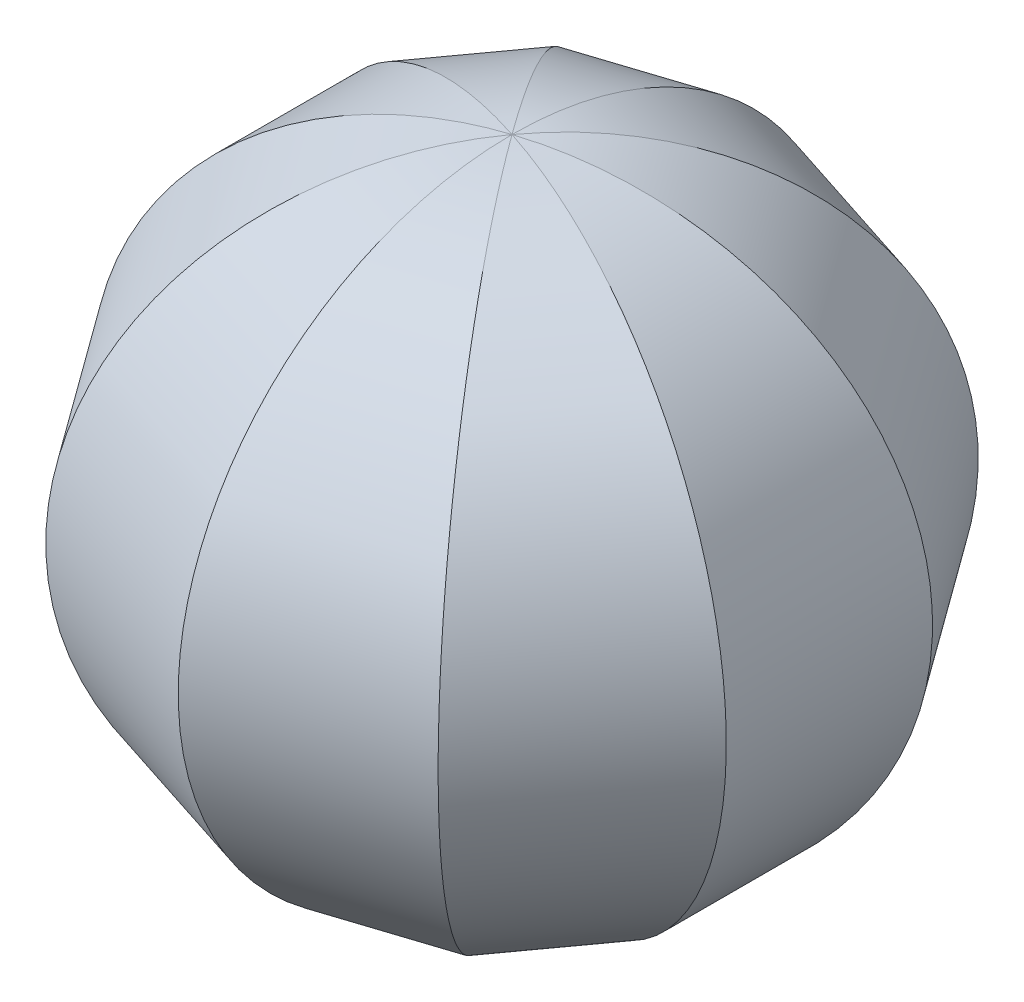
ISO-10303-21;
HEADER;
FILE_DESCRIPTION(('STEP AP214'),'2;1');
FILE_NAME('part.step','',(''),(''),'','','');
FILE_SCHEMA(('AUTOMOTIVE_DESIGN { 1 0 10303 214 1 1 1 1 }'));
ENDSEC;
DATA;
#1=APPLICATION_CONTEXT('core data for automotive mechanical design processes');
#2=APPLICATION_PROTOCOL_DEFINITION('international standard','automotive_design',2000,#1);
#3=PRODUCT_CONTEXT('',#1,'mechanical');
#4=PRODUCT('Part','Part','',(#3));
#5=PRODUCT_RELATED_PRODUCT_CATEGORY('part','',(#4));
#6=PRODUCT_DEFINITION_FORMATION('','',#4);
#7=PRODUCT_DEFINITION_CONTEXT('part definition',#1,'design');
#8=PRODUCT_DEFINITION('design','',#6,#7);
#9=PRODUCT_DEFINITION_SHAPE('','',#8);
#10=(LENGTH_UNIT() NAMED_UNIT(*) SI_UNIT(.MILLI.,.METRE.));
#11=(NAMED_UNIT(*) PLANE_ANGLE_UNIT() SI_UNIT($,.RADIAN.));
#12=(NAMED_UNIT(*) SI_UNIT($,.STERADIAN.) SOLID_ANGLE_UNIT());
#13=UNCERTAINTY_MEASURE_WITH_UNIT(LENGTH_MEASURE(1.E-05),#10,'distance_accuracy_value','');
#14=(GEOMETRIC_REPRESENTATION_CONTEXT(3) GLOBAL_UNCERTAINTY_ASSIGNED_CONTEXT((#13)) GLOBAL_UNIT_ASSIGNED_CONTEXT((#10,
#11,#12)) REPRESENTATION_CONTEXT('',''));
#15=CARTESIAN_POINT('',(0.,0.,0.));
#16=DIRECTION('',(0.,0.,1.));
#17=DIRECTION('',(1.,0.,0.));
#18=AXIS2_PLACEMENT_3D('',#15,#16,#17);
#19=CARTESIAN_POINT('',(1450.,-2626.30919733378,17382.735608421));
#20=DIRECTION('',(0.,-1.,0.));
#21=DIRECTION('',(1.,0.,0.));
#22=AXIS2_PLACEMENT_3D('',#19,#20,#21);
#23=PLANE('',#22);
#24=DIRECTION('',(0.587785252292462,0.,-0.809016994374955));
#25=VECTOR('',#24,1.);
#26=CARTESIAN_POINT('',(-8672.34824494125,-2626.30919733378,14403.3506765883));
#27=LINE('',#26,#25);
#28=CARTESIAN_POINT('',(896.149283687364,-2626.30919733378,1233.44367211045));
#29=VERTEX_POINT('',#28);
#30=CARTESIAN_POINT('',(1450.,-2626.30919733378,471.133559537705));
#31=VERTEX_POINT('',#30);
#32=EDGE_CURVE('E146',#29,#31,#27,.T.);
#33=ORIENTED_EDGE('',*,*,#32,.F.);
#34=DIRECTION('',(0.95105651629515,0.,-0.309016994374958));
#35=VECTOR('',#34,1.);
#36=CARTESIAN_POINT('',(-15482.1542225907,-2626.30919733378,6555.07707218086));
#37=LINE('',#36,#35);
#38=CARTESIAN_POINT('',(2.04281036531029E-11,-2626.30919733378,1524.62022514549));
#39=VERTEX_POINT('',#38);
#40=EDGE_CURVE('E220',#39,#29,#37,.T.);
#41=ORIENTED_EDGE('',*,*,#40,.F.);
#42=DIRECTION('',(0.951056516295157,0.,0.309016994374938));
#43=VECTOR('',#42,1.);
#44=CARTESIAN_POINT('',(-16378.3035062781,-2626.30919733378,-3797.01317492458));
#45=LINE('',#44,#43);
#46=CARTESIAN_POINT('',(-896.14928368734,-2626.30919733378,1233.44367211046));
#47=VERTEX_POINT('',#46);
#48=EDGE_CURVE('E224',#47,#39,#45,.T.);
#49=ORIENTED_EDGE('',*,*,#48,.F.);
#50=DIRECTION('',(0.58778525229248,0.,0.809016994374942));
#51=VECTOR('',#50,1.);
#52=CARTESIAN_POINT('',(-11018.4975286289,-2626.30919733378,-12698.77344494));
#53=LINE('',#52,#51);
#54=CARTESIAN_POINT('',(-1450.,-2626.30919733378,471.133559537726));
#55=VERTEX_POINT('',#54);
#56=EDGE_CURVE('E64',#55,#47,#53,.T.);
#57=ORIENTED_EDGE('',*,*,#56,.F.);
#58=DIRECTION('',(0.,0.,1.));
#59=VECTOR('',#58,1.);
#60=CARTESIAN_POINT('',(-1450.,-2626.30919733378,-16750.0338744229));
#61=LINE('',#60,#59);
#62=CARTESIAN_POINT('',(-1450.,-2626.30919733378,-471.133559537707));
#63=VERTEX_POINT('',#62);
#64=EDGE_CURVE('E234',#63,#55,#61,.T.);
#65=ORIENTED_EDGE('',*,*,#64,.F.);
#66=DIRECTION('',(-0.587785252292469,0.,0.809016994374951));
#67=VECTOR('',#66,1.);
#68=CARTESIAN_POINT('',(8672.34824494136,-2626.30919733378,-14403.3506765883));
#69=LINE('',#68,#67);
#70=CARTESIAN_POINT('',(-896.149283687354,-2626.30919733378,-1233.44367211045));
#71=VERTEX_POINT('',#70);
#72=EDGE_CURVE('E236',#71,#63,#69,.T.);
#73=ORIENTED_EDGE('',*,*,#72,.F.);
#74=DIRECTION('',(-0.951056516295152,0.,0.309016994374952));
#75=VECTOR('',#74,1.);
#76=CARTESIAN_POINT('',(15482.1542225907,-2626.30919733378,-6555.07707218075));
#77=LINE('',#76,#75);
#78=CARTESIAN_POINT('',(-5.32907051820075E-12,-2626.30919733378,-1524.62022514549));
#79=VERTEX_POINT('',#78);
#80=EDGE_CURVE('E239',#79,#71,#77,.T.);
#81=ORIENTED_EDGE('',*,*,#80,.F.);
#82=DIRECTION('',(-0.951056516295154,0.,-0.309016994374945));
#83=VECTOR('',#82,1.);
#84=CARTESIAN_POINT('',(16378.3035062781,-2626.30919733378,3797.01317492469));
#85=LINE('',#84,#83);
#86=CARTESIAN_POINT('',(896.149283687343,-2626.30919733378,-1233.44367211046));
#87=VERTEX_POINT('',#86);
#88=EDGE_CURVE('E242',#87,#79,#85,.T.);
#89=ORIENTED_EDGE('',*,*,#88,.F.);
#90=DIRECTION('',(-0.587785252292474,0.,-0.809016994374947));
#91=VECTOR('',#90,1.);
#92=CARTESIAN_POINT('',(11018.4975286288,-2626.30919733378,12698.77344494));
#93=LINE('',#92,#91);
#94=CARTESIAN_POINT('',(1450.,-2626.30919733378,-471.133559537715));
#95=VERTEX_POINT('',#94);
#96=EDGE_CURVE('E245',#95,#87,#93,.T.);
#97=ORIENTED_EDGE('',*,*,#96,.F.);
#98=DIRECTION('',(0.,0.,-1.));
#99=VECTOR('',#98,1.);
#100=CARTESIAN_POINT('',(1450.,-2626.30919733378,17382.735608421));
#101=LINE('',#100,#99);
#102=EDGE_CURVE('E248',#31,#95,#101,.T.);
#103=ORIENTED_EDGE('',*,*,#102,.F.);
#104=EDGE_LOOP('',(#33,#41,#49,#57,#65,#73,#81,#89,#97,#103));
#105=FACE_BOUND('',#104,.T.);
#106=DIRECTION('',(0.95105651629515,0.,-0.309016994374958));
#107=VECTOR('',#106,1.);
#108=CARTESIAN_POINT('',(1.420765048581E-11,-2626.30919733378,1480.62160019577));
#109=LINE('',#108,#107);
#110=CARTESIAN_POINT('',(1.420765048581E-11,-2626.30919733378,1480.62160019577));
#111=VERTEX_POINT('',#110);
#112=CARTESIAN_POINT('',(870.287540820769,-2626.30919733378,1197.84803679699));
#113=VERTEX_POINT('',#112);
#114=EDGE_CURVE('E137',#111,#113,#109,.T.);
#115=ORIENTED_EDGE('',*,*,#114,.T.);
#116=DIRECTION('',(0.587785252292462,0.,-0.809016994374955));
#117=VECTOR('',#116,1.);
#118=CARTESIAN_POINT('',(870.287540820769,-2626.30919733378,1197.84803679699));
#119=LINE('',#118,#117);
#120=CARTESIAN_POINT('',(1408.15482103354,-2626.30919733378,457.537236699109));
#121=VERTEX_POINT('',#120);
#122=EDGE_CURVE('E138',#113,#121,#119,.T.);
#123=ORIENTED_EDGE('',*,*,#122,.T.);
#124=DIRECTION('',(0.,0.,-1.));
#125=VECTOR('',#124,1.);
#126=CARTESIAN_POINT('',(1408.15482103354,-2626.30919733378,457.537236699109));
#127=LINE('',#126,#125);
#128=CARTESIAN_POINT('',(1408.15482103354,-2626.30919733378,-457.537236699118));
#129=VERTEX_POINT('',#128);
#130=EDGE_CURVE('E133',#121,#129,#127,.T.);
#131=ORIENTED_EDGE('',*,*,#130,.T.);
#132=DIRECTION('',(-0.587785252292474,0.,-0.809016994374947));
#133=VECTOR('',#132,1.);
#134=CARTESIAN_POINT('',(1408.15482103354,-2626.30919733378,-457.537236699118));
#135=LINE('',#134,#133);
#136=CARTESIAN_POINT('',(870.287540820748,-2626.30919733378,-1197.84803679701));
#137=VERTEX_POINT('',#136);
#138=EDGE_CURVE('E56',#129,#137,#135,.T.);
#139=ORIENTED_EDGE('',*,*,#138,.T.);
#140=DIRECTION('',(-0.951056516295154,0.,-0.309016994374945));
#141=VECTOR('',#140,1.);
#142=CARTESIAN_POINT('',(870.287540820748,-2626.30919733378,-1197.84803679701));
#143=LINE('',#142,#141);
#144=CARTESIAN_POINT('',(-3.6720389837431E-12,-2626.30919733378,-1480.62160019577));
#145=VERTEX_POINT('',#144);
#146=EDGE_CURVE('E199',#137,#145,#143,.T.);
#147=ORIENTED_EDGE('',*,*,#146,.T.);
#148=DIRECTION('',(-0.951056516295152,0.,0.309016994374952));
#149=VECTOR('',#148,1.);
#150=CARTESIAN_POINT('',(-3.6720389837431E-12,-2626.30919733378,-1480.62160019577));
#151=LINE('',#150,#149);
#152=CARTESIAN_POINT('',(-870.287540820761,-2626.30919733378,-1197.848036797));
#153=VERTEX_POINT('',#152);
#154=EDGE_CURVE('E192',#145,#153,#151,.T.);
#155=ORIENTED_EDGE('',*,*,#154,.T.);
#156=DIRECTION('',(-0.587785252292469,0.,0.809016994374951));
#157=VECTOR('',#156,1.);
#158=CARTESIAN_POINT('',(-870.287540820761,-2626.30919733378,-1197.848036797));
#159=LINE('',#158,#157);
#160=CARTESIAN_POINT('',(-1408.15482103354,-2626.30919733378,-457.537236699117));
#161=VERTEX_POINT('',#160);
#162=EDGE_CURVE('E183',#153,#161,#159,.T.);
#163=ORIENTED_EDGE('',*,*,#162,.T.);
#164=DIRECTION('',(0.,0.,-1.));
#165=VECTOR('',#164,1.);
#166=CARTESIAN_POINT('',(-1408.15482103354,-2626.30919733378,-457.537236699117));
#167=LINE('',#166,#165);
#168=CARTESIAN_POINT('',(-1408.15482103354,-2626.30919733378,457.537236699128));
#169=VERTEX_POINT('',#168);
#170=EDGE_CURVE('E171',#161,#169,#167,.F.);
#171=ORIENTED_EDGE('',*,*,#170,.T.);
#172=DIRECTION('',(0.58778525229248,0.,0.809016994374942));
#173=VECTOR('',#172,1.);
#174=CARTESIAN_POINT('',(-1408.15482103354,-2626.30919733378,457.537236699128));
#175=LINE('',#174,#173);
#176=CARTESIAN_POINT('',(-870.287540820743,-2626.30919733378,1197.84803679701));
#177=VERTEX_POINT('',#176);
#178=EDGE_CURVE('E162',#169,#177,#175,.T.);
#179=ORIENTED_EDGE('',*,*,#178,.T.);
#180=DIRECTION('',(0.951056516295157,0.,0.309016994374938));
#181=VECTOR('',#180,1.);
#182=CARTESIAN_POINT('',(-870.287540820743,-2626.30919733378,1197.84803679701));
#183=LINE('',#182,#181);
#184=EDGE_CURVE('E159',#177,#111,#183,.T.);
#185=ORIENTED_EDGE('',*,*,#184,.T.);
#186=EDGE_LOOP('',(#115,#123,#131,#139,#147,#155,#163,#171,#179,#185));
#187=FACE_BOUND('',#186,.T.);
#188=ADVANCED_FACE('F41',(#105,#187),#23,.T.);
#189=CARTESIAN_POINT('',(0.,0.,17382.735608421));
#190=DIRECTION('',(0.,0.,-1.));
#191=DIRECTION('',(-1.,0.,0.));
#192=AXIS2_PLACEMENT_3D('',#189,#190,#191);
#193=CYLINDRICAL_SURFACE('',#192,3000.);
#194=CARTESIAN_POINT('',(8.88178419700125E-13,0.,1.77635683940025E-12));
#195=DIRECTION('',(-0.309016994374948,0.,-0.951056516295153));
#196=DIRECTION('',(0.951056516295153,0.,-0.309016994374948));
#197=AXIS2_PLACEMENT_3D('',#194,#195,#196);
#198=ELLIPSE('',#197,3154.3866727148,3000.);
#199=CARTESIAN_POINT('',(0.,3000.,-1.77635683940025E-12));
#200=VERTEX_POINT('',#199);
#201=EDGE_CURVE('E250',#95,#200,#198,.F.);
#202=ORIENTED_EDGE('',*,*,#201,.T.);
#203=CARTESIAN_POINT('',(0.,0.,0.));
#204=DIRECTION('',(0.309016994374941,0.,-0.951056516295156));
#205=DIRECTION('',(-0.951056516295156,0.,-0.309016994374941));
#206=AXIS2_PLACEMENT_3D('',#203,#204,#205);
#207=ELLIPSE('',#206,3154.3866727148,3000.);
#208=EDGE_CURVE('E218',#200,#31,#207,.T.);
#209=ORIENTED_EDGE('',*,*,#208,.T.);
#210=ORIENTED_EDGE('',*,*,#102,.T.);
#211=EDGE_LOOP('',(#202,#209,#210));
#212=FACE_BOUND('',#211,.T.);
#213=ADVANCED_FACE('F43',(#212),#193,.T.);
#214=CARTESIAN_POINT('',(-15930.2288644344,0.,5176.04512355289));
#215=DIRECTION('',(0.95105651629515,0.,-0.309016994374958));
#216=DIRECTION('',(-0.309016994374958,0.,-0.95105651629515));
#217=AXIS2_PLACEMENT_3D('',#214,#215,#216);
#218=CYLINDRICAL_SURFACE('',#217,3000.);
#219=ORIENTED_EDGE('',*,*,#40,.T.);
#220=CARTESIAN_POINT('',(1.77635683940025E-12,0.,-8.88178419700125E-13));
#221=DIRECTION('',(0.80901699437494,0.,-0.587785252292483));
#222=DIRECTION('',(0.587785252292483,0.,0.80901699437494));
#223=AXIS2_PLACEMENT_3D('',#220,#221,#222);
#224=ELLIPSE('',#223,3154.3866727148,3000.);
#225=EDGE_CURVE('E11',#29,#200,#224,.F.);
#226=ORIENTED_EDGE('',*,*,#225,.T.);
#227=CARTESIAN_POINT('',(0.,0.,0.));
#228=DIRECTION('',(1.,0.,0.));
#229=DIRECTION('',(0.,0.,1.));
#230=AXIS2_PLACEMENT_3D('',#227,#228,#229);
#231=ELLIPSE('',#230,3154.3866727148,3000.);
#232=EDGE_CURVE('E49',#39,#200,#231,.F.);
#233=ORIENTED_EDGE('',*,*,#232,.F.);
#234=EDGE_LOOP('',(#219,#226,#233));
#235=FACE_BOUND('',#234,.T.);
#236=ADVANCED_FACE('F295',(#235),#218,.T.);
#237=CARTESIAN_POINT('',(-15930.2288644345,0.,-5176.04512355256));
#238=DIRECTION('',(0.951056516295157,0.,0.309016994374938));
#239=DIRECTION('',(0.309016994374938,0.,-0.951056516295157));
#240=AXIS2_PLACEMENT_3D('',#237,#238,#239);
#241=CYLINDRICAL_SURFACE('',#240,3000.);
#242=ORIENTED_EDGE('',*,*,#48,.T.);
#243=ORIENTED_EDGE('',*,*,#232,.T.);
#244=CARTESIAN_POINT('',(-2.66453525910038E-12,0.,-1.77635683940025E-12));
#245=DIRECTION('',(0.809016994374953,0.,0.587785252292466));
#246=DIRECTION('',(-0.587785252292466,0.,0.809016994374953));
#247=AXIS2_PLACEMENT_3D('',#244,#245,#246);
#248=ELLIPSE('',#247,3154.3866727148,3000.);
#249=EDGE_CURVE('E230',#47,#200,#248,.F.);
#250=ORIENTED_EDGE('',*,*,#249,.F.);
#251=EDGE_LOOP('',(#242,#243,#250));
#252=FACE_BOUND('',#251,.T.);
#253=ADVANCED_FACE('F269',(#252),#241,.T.);
#254=CARTESIAN_POINT('',(-9845.42288678524,0.,-13551.0620607641));
#255=DIRECTION('',(0.58778525229248,0.,0.809016994374942));
#256=DIRECTION('',(0.809016994374942,0.,-0.58778525229248));
#257=AXIS2_PLACEMENT_3D('',#254,#255,#256);
#258=CYLINDRICAL_SURFACE('',#257,3000.);
#259=ORIENTED_EDGE('',*,*,#56,.T.);
#260=ORIENTED_EDGE('',*,*,#249,.T.);
#261=CARTESIAN_POINT('',(8.88178419700125E-13,0.,5.32907051820075E-12));
#262=DIRECTION('',(-0.309016994374952,0.,-0.951056516295152));
#263=DIRECTION('',(0.951056516295152,0.,-0.309016994374952));
#264=AXIS2_PLACEMENT_3D('',#261,#262,#263);
#265=ELLIPSE('',#264,3154.38667271481,3000.);
#266=EDGE_CURVE('E228',#55,#200,#265,.T.);
#267=ORIENTED_EDGE('',*,*,#266,.F.);
#268=EDGE_LOOP('',(#259,#260,#267));
#269=FACE_BOUND('',#268,.T.);
#270=ADVANCED_FACE('F274',(#269),#258,.T.);
#271=ORIENTED_EDGE('',*,*,#64,.T.);
#272=ORIENTED_EDGE('',*,*,#266,.T.);
#273=CARTESIAN_POINT('',(0.,0.,0.));
#274=DIRECTION('',(-0.309016994374945,0.,0.951056516295155));
#275=DIRECTION('',(-0.951056516295154,0.,-0.309016994374945));
#276=AXIS2_PLACEMENT_3D('',#273,#274,#275);
#277=ELLIPSE('',#276,3154.3866727148,3000.);
#278=EDGE_CURVE('E231',#63,#200,#277,.F.);
#279=ORIENTED_EDGE('',*,*,#278,.F.);
#280=EDGE_LOOP('',(#271,#272,#279));
#281=FACE_BOUND('',#280,.T.);
#282=ADVANCED_FACE('F276',(#281),#193,.T.);
#283=CARTESIAN_POINT('',(9845.42288678504,0.,-13551.0620607642));
#284=DIRECTION('',(-0.587785252292469,0.,0.809016994374951));
#285=DIRECTION('',(0.809016994374951,0.,0.587785252292469));
#286=AXIS2_PLACEMENT_3D('',#283,#284,#285);
#287=CYLINDRICAL_SURFACE('',#286,3000.);
#288=ORIENTED_EDGE('',*,*,#72,.T.);
#289=ORIENTED_EDGE('',*,*,#278,.T.);
#290=CARTESIAN_POINT('',(-3.5527136788005E-12,0.,3.10862446895044E-12));
#291=DIRECTION('',(-0.809016994374944,0.,0.587785252292477));
#292=DIRECTION('',(-0.587785252292477,0.,-0.809016994374945));
#293=AXIS2_PLACEMENT_3D('',#290,#291,#292);
#294=ELLIPSE('',#293,3154.3866727148,3000.);
#295=EDGE_CURVE('E259',#71,#200,#294,.F.);
#296=ORIENTED_EDGE('',*,*,#295,.F.);
#297=EDGE_LOOP('',(#288,#289,#296));
#298=FACE_BOUND('',#297,.T.);
#299=ADVANCED_FACE('F278',(#298),#287,.T.);
#300=CARTESIAN_POINT('',(15930.2288644344,0.,-5176.04512355278));
#301=DIRECTION('',(-0.951056516295152,0.,0.309016994374952));
#302=DIRECTION('',(0.309016994374952,0.,0.951056516295152));
#303=AXIS2_PLACEMENT_3D('',#300,#301,#302);
#304=CYLINDRICAL_SURFACE('',#303,3000.);
#305=ORIENTED_EDGE('',*,*,#80,.T.);
#306=ORIENTED_EDGE('',*,*,#295,.T.);
#307=CARTESIAN_POINT('',(-4.44089209850063E-12,0.,-8.88178419700125E-13));
#308=DIRECTION('',(-1.,0.,0.));
#309=DIRECTION('',(0.,0.,-1.));
#310=AXIS2_PLACEMENT_3D('',#307,#308,#309);
#311=ELLIPSE('',#310,3154.3866727148,3000.);
#312=EDGE_CURVE('E256',#79,#200,#311,.F.);
#313=ORIENTED_EDGE('',*,*,#312,.F.);
#314=EDGE_LOOP('',(#305,#306,#313));
#315=FACE_BOUND('',#314,.T.);
#316=ADVANCED_FACE('F281',(#315),#304,.T.);
#317=CARTESIAN_POINT('',(15930.2288644344,0.,5176.04512355267));
#318=DIRECTION('',(-0.951056516295154,0.,-0.309016994374945));
#319=DIRECTION('',(-0.309016994374945,0.,0.951056516295155));
#320=AXIS2_PLACEMENT_3D('',#317,#318,#319);
#321=CYLINDRICAL_SURFACE('',#320,3000.);
#322=ORIENTED_EDGE('',*,*,#88,.T.);
#323=ORIENTED_EDGE('',*,*,#312,.T.);
#324=CARTESIAN_POINT('',(2.66453525910038E-12,0.,2.22044604925031E-12));
#325=DIRECTION('',(-0.809016994374949,0.,-0.587785252292471));
#326=DIRECTION('',(0.587785252292471,0.,-0.809016994374949));
#327=AXIS2_PLACEMENT_3D('',#324,#325,#326);
#328=ELLIPSE('',#327,3154.3866727148,3000.);
#329=EDGE_CURVE('E253',#87,#200,#328,.F.);
#330=ORIENTED_EDGE('',*,*,#329,.F.);
#331=EDGE_LOOP('',(#322,#323,#330));
#332=FACE_BOUND('',#331,.T.);
#333=ADVANCED_FACE('F284',(#332),#321,.T.);
#334=CARTESIAN_POINT('',(9845.42288678514,0.,13551.0620607641));
#335=DIRECTION('',(-0.587785252292474,0.,-0.809016994374947));
#336=DIRECTION('',(-0.809016994374947,0.,0.587785252292474));
#337=AXIS2_PLACEMENT_3D('',#334,#335,#336);
#338=CYLINDRICAL_SURFACE('',#337,3000.);
#339=ORIENTED_EDGE('',*,*,#96,.T.);
#340=ORIENTED_EDGE('',*,*,#329,.T.);
#341=ORIENTED_EDGE('',*,*,#201,.F.);
#342=EDGE_LOOP('',(#339,#340,#341));
#343=FACE_BOUND('',#342,.T.);
#344=ADVANCED_FACE('F288',(#343),#338,.T.);
#345=CARTESIAN_POINT('',(-9845.42288678494,0.,13551.0620607643));
#346=DIRECTION('',(0.587785252292462,0.,-0.809016994374955));
#347=DIRECTION('',(-0.809016994374955,0.,-0.587785252292462));
#348=AXIS2_PLACEMENT_3D('',#345,#346,#347);
#349=CYLINDRICAL_SURFACE('',#348,3000.);
#350=ORIENTED_EDGE('',*,*,#32,.T.);
#351=ORIENTED_EDGE('',*,*,#208,.F.);
#352=ORIENTED_EDGE('',*,*,#225,.F.);
#353=EDGE_LOOP('',(#350,#351,#352));
#354=FACE_BOUND('',#353,.T.);
#355=ADVANCED_FACE('F296',(#354),#349,.T.);
#356=CARTESIAN_POINT('',(0.,0.,17382.735608421));
#357=DIRECTION('',(0.,0.,-1.));
#358=DIRECTION('',(-1.,0.,0.));
#359=AXIS2_PLACEMENT_3D('',#356,#357,#358);
#360=CYLINDRICAL_SURFACE('',#359,2980.);
#361=CARTESIAN_POINT('',(8.88178419700125E-13,0.,1.77635683940025E-12));
#362=DIRECTION('',(-0.309016994374948,0.,-0.951056516295153));
#363=DIRECTION('',(0.951056516295153,0.,-0.309016994374948));
#364=AXIS2_PLACEMENT_3D('',#361,#362,#363);
#365=ELLIPSE('',#364,3133.35742823004,2980.);
#366=CARTESIAN_POINT('',(-1.21826488982594E-12,2980.,-8.85121252834288E-13));
#367=VERTEX_POINT('',#366);
#368=EDGE_CURVE('E131',#129,#367,#365,.F.);
#369=ORIENTED_EDGE('',*,*,#368,.F.);
#370=ORIENTED_EDGE('',*,*,#130,.F.);
#371=CARTESIAN_POINT('',(0.,0.,0.));
#372=DIRECTION('',(0.309016994374941,0.,-0.951056516295156));
#373=DIRECTION('',(-0.951056516295156,0.,-0.309016994374941));
#374=AXIS2_PLACEMENT_3D('',#371,#372,#373);
#375=ELLIPSE('',#374,3133.35742823003,2980.);
#376=EDGE_CURVE('E128',#367,#121,#375,.T.);
#377=ORIENTED_EDGE('',*,*,#376,.F.);
#378=EDGE_LOOP('',(#369,#370,#377));
#379=FACE_BOUND('',#378,.T.);
#380=ADVANCED_FACE('F130',(#379),#360,.F.);
#381=CARTESIAN_POINT('',(-15930.2288644344,0.,5176.04512355289));
#382=DIRECTION('',(0.95105651629515,0.,-0.309016994374958));
#383=DIRECTION('',(-0.309016994374958,0.,-0.95105651629515));
#384=AXIS2_PLACEMENT_3D('',#381,#382,#383);
#385=CYLINDRICAL_SURFACE('',#384,2980.);
#386=ORIENTED_EDGE('',*,*,#114,.F.);
#387=CARTESIAN_POINT('',(0.,0.,0.));
#388=DIRECTION('',(1.,0.,0.));
#389=DIRECTION('',(0.,0.,1.));
#390=AXIS2_PLACEMENT_3D('',#387,#388,#389);
#391=ELLIPSE('',#390,3133.35742823004,2980.);
#392=EDGE_CURVE('E147',#111,#367,#391,.F.);
#393=ORIENTED_EDGE('',*,*,#392,.T.);
#394=CARTESIAN_POINT('',(1.77635683940025E-12,0.,-8.88178419700125E-13));
#395=DIRECTION('',(0.80901699437494,0.,-0.587785252292483));
#396=DIRECTION('',(0.587785252292483,0.,0.80901699437494));
#397=AXIS2_PLACEMENT_3D('',#394,#395,#396);
#398=ELLIPSE('',#397,3133.35742823004,2980.);
#399=EDGE_CURVE('E140',#113,#367,#398,.F.);
#400=ORIENTED_EDGE('',*,*,#399,.F.);
#401=EDGE_LOOP('',(#386,#393,#400));
#402=FACE_BOUND('',#401,.T.);
#403=ADVANCED_FACE('F150',(#402),#385,.F.);
#404=CARTESIAN_POINT('',(-15930.2288644345,0.,-5176.04512355256));
#405=DIRECTION('',(0.951056516295157,0.,0.309016994374938));
#406=DIRECTION('',(0.309016994374938,0.,-0.951056516295157));
#407=AXIS2_PLACEMENT_3D('',#404,#405,#406);
#408=CYLINDRICAL_SURFACE('',#407,2980.);
#409=ORIENTED_EDGE('',*,*,#184,.F.);
#410=CARTESIAN_POINT('',(-2.66453525910038E-12,0.,-1.77635683940025E-12));
#411=DIRECTION('',(0.809016994374953,0.,0.587785252292466));
#412=DIRECTION('',(-0.587785252292466,0.,0.809016994374953));
#413=AXIS2_PLACEMENT_3D('',#410,#411,#412);
#414=ELLIPSE('',#413,3133.35742823004,2980.);
#415=EDGE_CURVE('E155',#177,#367,#414,.F.);
#416=ORIENTED_EDGE('',*,*,#415,.T.);
#417=ORIENTED_EDGE('',*,*,#392,.F.);
#418=EDGE_LOOP('',(#409,#416,#417));
#419=FACE_BOUND('',#418,.T.);
#420=ADVANCED_FACE('F158',(#419),#408,.F.);
#421=CARTESIAN_POINT('',(-9845.42288678524,0.,-13551.0620607641));
#422=DIRECTION('',(0.58778525229248,0.,0.809016994374942));
#423=DIRECTION('',(0.809016994374942,0.,-0.58778525229248));
#424=AXIS2_PLACEMENT_3D('',#421,#422,#423);
#425=CYLINDRICAL_SURFACE('',#424,2980.);
#426=ORIENTED_EDGE('',*,*,#178,.F.);
#427=CARTESIAN_POINT('',(8.88178419700125E-13,0.,5.32907051820075E-12));
#428=DIRECTION('',(-0.309016994374952,0.,-0.951056516295152));
#429=DIRECTION('',(0.951056516295152,0.,-0.309016994374952));
#430=AXIS2_PLACEMENT_3D('',#427,#428,#429);
#431=ELLIPSE('',#430,3133.35742823004,2980.);
#432=EDGE_CURVE('E165',#169,#367,#431,.T.);
#433=ORIENTED_EDGE('',*,*,#432,.T.);
#434=ORIENTED_EDGE('',*,*,#415,.F.);
#435=EDGE_LOOP('',(#426,#433,#434));
#436=FACE_BOUND('',#435,.T.);
#437=ADVANCED_FACE('F167',(#436),#425,.F.);
#438=ORIENTED_EDGE('',*,*,#170,.F.);
#439=CARTESIAN_POINT('',(0.,0.,0.));
#440=DIRECTION('',(-0.309016994374945,0.,0.951056516295155));
#441=DIRECTION('',(-0.951056516295154,0.,-0.309016994374945));
#442=AXIS2_PLACEMENT_3D('',#439,#440,#441);
#443=ELLIPSE('',#442,3133.35742823003,2980.);
#444=EDGE_CURVE('E173',#161,#367,#443,.F.);
#445=ORIENTED_EDGE('',*,*,#444,.T.);
#446=ORIENTED_EDGE('',*,*,#432,.F.);
#447=EDGE_LOOP('',(#438,#445,#446));
#448=FACE_BOUND('',#447,.T.);
#449=ADVANCED_FACE('F175',(#448),#360,.F.);
#450=CARTESIAN_POINT('',(9845.42288678504,0.,-13551.0620607642));
#451=DIRECTION('',(-0.587785252292469,0.,0.809016994374951));
#452=DIRECTION('',(0.809016994374951,0.,0.587785252292469));
#453=AXIS2_PLACEMENT_3D('',#450,#451,#452);
#454=CYLINDRICAL_SURFACE('',#453,2980.);
#455=ORIENTED_EDGE('',*,*,#162,.F.);
#456=CARTESIAN_POINT('',(-3.5527136788005E-12,0.,3.10862446895044E-12));
#457=DIRECTION('',(-0.809016994374944,0.,0.587785252292477));
#458=DIRECTION('',(-0.587785252292477,0.,-0.809016994374945));
#459=AXIS2_PLACEMENT_3D('',#456,#457,#458);
#460=ELLIPSE('',#459,3133.35742823004,2980.);
#461=EDGE_CURVE('E179',#153,#367,#460,.F.);
#462=ORIENTED_EDGE('',*,*,#461,.T.);
#463=ORIENTED_EDGE('',*,*,#444,.F.);
#464=EDGE_LOOP('',(#455,#462,#463));
#465=FACE_BOUND('',#464,.T.);
#466=ADVANCED_FACE('F182',(#465),#454,.F.);
#467=CARTESIAN_POINT('',(15930.2288644344,0.,-5176.04512355278));
#468=DIRECTION('',(-0.951056516295152,0.,0.309016994374952));
#469=DIRECTION('',(0.309016994374952,0.,0.951056516295152));
#470=AXIS2_PLACEMENT_3D('',#467,#468,#469);
#471=CYLINDRICAL_SURFACE('',#470,2980.);
#472=ORIENTED_EDGE('',*,*,#154,.F.);
#473=CARTESIAN_POINT('',(-4.44089209850063E-12,0.,-8.88178419700125E-13));
#474=DIRECTION('',(-1.,0.,0.));
#475=DIRECTION('',(0.,0.,-1.));
#476=AXIS2_PLACEMENT_3D('',#473,#474,#475);
#477=ELLIPSE('',#476,3133.35742823004,2980.);
#478=EDGE_CURVE('E188',#145,#367,#477,.F.);
#479=ORIENTED_EDGE('',*,*,#478,.T.);
#480=ORIENTED_EDGE('',*,*,#461,.F.);
#481=EDGE_LOOP('',(#472,#479,#480));
#482=FACE_BOUND('',#481,.T.);
#483=ADVANCED_FACE('F191',(#482),#471,.F.);
#484=CARTESIAN_POINT('',(15930.2288644344,0.,5176.04512355267));
#485=DIRECTION('',(-0.951056516295154,0.,-0.309016994374945));
#486=DIRECTION('',(-0.309016994374945,0.,0.951056516295155));
#487=AXIS2_PLACEMENT_3D('',#484,#485,#486);
#488=CYLINDRICAL_SURFACE('',#487,2980.);
#489=ORIENTED_EDGE('',*,*,#146,.F.);
#490=CARTESIAN_POINT('',(2.66453525910038E-12,0.,2.22044604925031E-12));
#491=DIRECTION('',(-0.809016994374949,0.,-0.587785252292471));
#492=DIRECTION('',(0.587785252292471,0.,-0.809016994374949));
#493=AXIS2_PLACEMENT_3D('',#490,#491,#492);
#494=ELLIPSE('',#493,3133.35742823004,2980.);
#495=EDGE_CURVE('E196',#137,#367,#494,.F.);
#496=ORIENTED_EDGE('',*,*,#495,.T.);
#497=ORIENTED_EDGE('',*,*,#478,.F.);
#498=EDGE_LOOP('',(#489,#496,#497));
#499=FACE_BOUND('',#498,.T.);
#500=ADVANCED_FACE('F198',(#499),#488,.F.);
#501=CARTESIAN_POINT('',(9845.42288678514,0.,13551.0620607641));
#502=DIRECTION('',(-0.587785252292474,0.,-0.809016994374947));
#503=DIRECTION('',(-0.809016994374947,0.,0.587785252292474));
#504=AXIS2_PLACEMENT_3D('',#501,#502,#503);
#505=CYLINDRICAL_SURFACE('',#504,2980.);
#506=ORIENTED_EDGE('',*,*,#138,.F.);
#507=ORIENTED_EDGE('',*,*,#368,.T.);
#508=ORIENTED_EDGE('',*,*,#495,.F.);
#509=EDGE_LOOP('',(#506,#507,#508));
#510=FACE_BOUND('',#509,.T.);
#511=ADVANCED_FACE('F201',(#510),#505,.F.);
#512=CARTESIAN_POINT('',(-9845.42288678494,0.,13551.0620607643));
#513=DIRECTION('',(0.587785252292462,0.,-0.809016994374955));
#514=DIRECTION('',(-0.809016994374955,0.,-0.587785252292462));
#515=AXIS2_PLACEMENT_3D('',#512,#513,#514);
#516=CYLINDRICAL_SURFACE('',#515,2980.);
#517=ORIENTED_EDGE('',*,*,#122,.F.);
#518=ORIENTED_EDGE('',*,*,#399,.T.);
#519=ORIENTED_EDGE('',*,*,#376,.T.);
#520=EDGE_LOOP('',(#517,#518,#519));
#521=FACE_BOUND('',#520,.T.);
#522=ADVANCED_FACE('F142',(#521),#516,.F.);
#523=CLOSED_SHELL('',(#188,#213,#236,#253,#270,#282,#299,#316,#333,#344,#355,#380,#403,#420,
#437,#449,#466,#483,#500,#511,#522));
#524=MANIFOLD_SOLID_BREP('B2',#523);
#525=ADVANCED_BREP_SHAPE_REPRESENTATION('',(#18,#524),#14);
#526=SHAPE_DEFINITION_REPRESENTATION(#9,#525);
ENDSEC;
END-ISO-10303-21;
